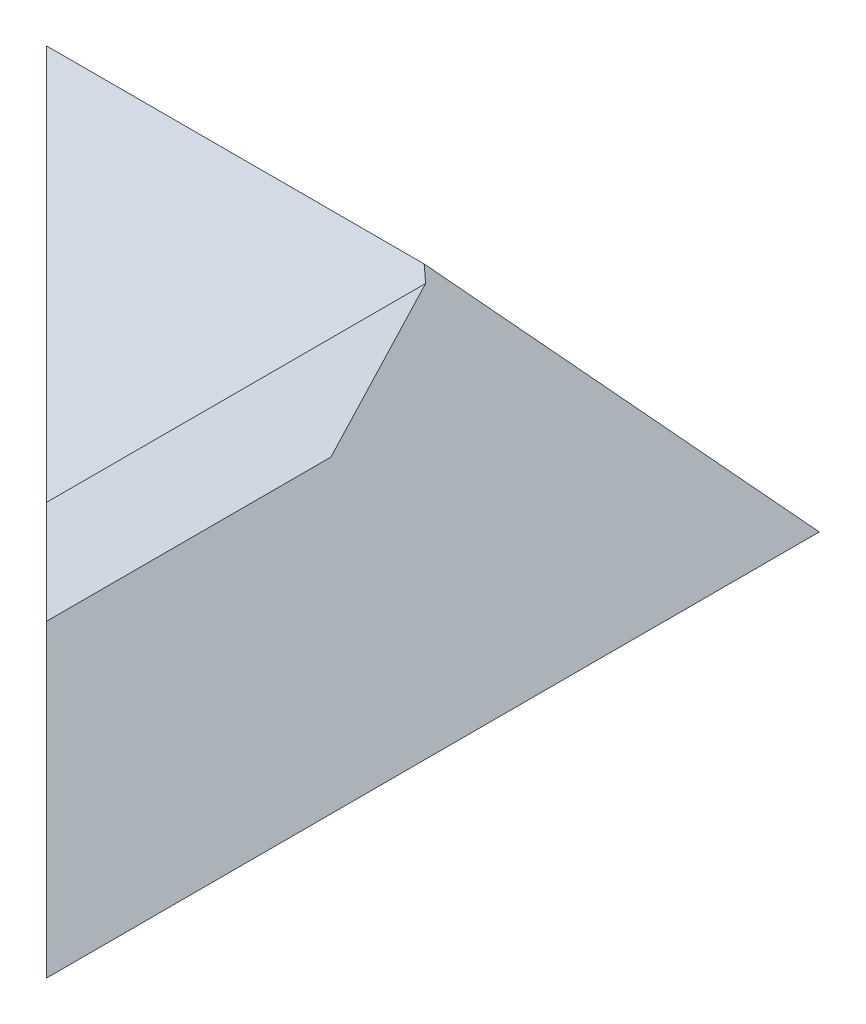
ISO-10303-21;
HEADER;
FILE_DESCRIPTION(('STEP AP214'),'2;1');
FILE_NAME('part.step','',(''),(''),'','','');
FILE_SCHEMA(('AUTOMOTIVE_DESIGN { 1 0 10303 214 1 1 1 1 }'));
ENDSEC;
DATA;
#1=APPLICATION_CONTEXT('core data for automotive mechanical design processes');
#2=APPLICATION_PROTOCOL_DEFINITION('international standard','automotive_design',2000,#1);
#3=PRODUCT_CONTEXT('',#1,'mechanical');
#4=PRODUCT('Part','Part','',(#3));
#5=PRODUCT_RELATED_PRODUCT_CATEGORY('part','',(#4));
#6=PRODUCT_DEFINITION_FORMATION('','',#4);
#7=PRODUCT_DEFINITION_CONTEXT('part definition',#1,'design');
#8=PRODUCT_DEFINITION('design','',#6,#7);
#9=PRODUCT_DEFINITION_SHAPE('','',#8);
#10=(LENGTH_UNIT() NAMED_UNIT(*) SI_UNIT(.MILLI.,.METRE.));
#11=(NAMED_UNIT(*) PLANE_ANGLE_UNIT() SI_UNIT($,.RADIAN.));
#12=(NAMED_UNIT(*) SI_UNIT($,.STERADIAN.) SOLID_ANGLE_UNIT());
#13=UNCERTAINTY_MEASURE_WITH_UNIT(LENGTH_MEASURE(1.E-05),#10,'distance_accuracy_value','');
#14=(GEOMETRIC_REPRESENTATION_CONTEXT(3) GLOBAL_UNCERTAINTY_ASSIGNED_CONTEXT((#13)) GLOBAL_UNIT_ASSIGNED_CONTEXT((#10,
#11,#12)) REPRESENTATION_CONTEXT('',''));
#15=CARTESIAN_POINT('',(0.,0.,0.));
#16=DIRECTION('',(0.,0.,1.));
#17=DIRECTION('',(1.,0.,0.));
#18=AXIS2_PLACEMENT_3D('',#15,#16,#17);
#19=CARTESIAN_POINT('',(58.0761184457489,0.,-11.9238815542511));
#20=DIRECTION('',(0.431038989319619,-0.792723646280747,-0.431038989319619));
#21=DIRECTION('',(0.,0.47769376115336,-0.878526419952841));
#22=AXIS2_PLACEMENT_3D('',#19,#20,#21);
#23=PLANE('',#22);
#24=DIRECTION('',(0.608120402411346,0.608120402411339,-0.510273605374738));
#25=VECTOR('',#24,1.);
#26=CARTESIAN_POINT('',(93.5701580153135,3.57015801531349,17.0042817261058));
#27=LINE('',#26,#25);
#28=CARTESIAN_POINT('',(90.,0.,20.));
#29=VERTEX_POINT('',#28);
#30=CARTESIAN_POINT('',(120.,29.9999999999998,-5.17298893531846));
#31=VERTEX_POINT('',#30);
#32=EDGE_CURVE('E190',#29,#31,#27,.T.);
#33=ORIENTED_EDGE('',*,*,#32,.T.);
#34=DIRECTION('',(-0.315275703929743,0.315275703929743,-0.895099134746096));
#35=VECTOR('',#34,1.);
#36=CARTESIAN_POINT('',(114.921683240356,35.0783167596445,-19.590836174627));
#37=LINE('',#36,#35);
#38=CARTESIAN_POINT('',(110.,39.9999999999998,-33.5639852470914));
#39=VERTEX_POINT('',#38);
#40=EDGE_CURVE('E195',#31,#39,#37,.T.);
#41=ORIENTED_EDGE('',*,*,#40,.T.);
#42=DIRECTION('',(-0.608120402411345,-0.608120402411339,0.510273605374739));
#43=VECTOR('',#42,1.);
#44=CARTESIAN_POINT('',(99.5848339063149,29.5848339063146,-24.8246232192299));
#45=LINE('',#44,#43);
#46=CARTESIAN_POINT('',(70.,0.,0.));
#47=VERTEX_POINT('',#46);
#48=EDGE_CURVE('E192',#39,#47,#45,.T.);
#49=ORIENTED_EDGE('',*,*,#48,.T.);
#50=DIRECTION('',(0.707106781186547,0.,0.707106781186547));
#51=VECTOR('',#50,1.);
#52=CARTESIAN_POINT('',(58.0761184457489,0.,-11.9238815542511));
#53=LINE('',#52,#51);
#54=EDGE_CURVE('E193',#47,#29,#53,.T.);
#55=ORIENTED_EDGE('',*,*,#54,.T.);
#56=EDGE_LOOP('',(#33,#41,#49,#55));
#57=FACE_BOUND('',#56,.T.);
#58=ADVANCED_FACE('F30',(#57),#23,.F.);
#59=CARTESIAN_POINT('',(150.,41.7113757407969,-35.));
#60=DIRECTION('',(0.,-0.642787609686544,0.766044443118974));
#61=DIRECTION('',(0.,-0.766044443118974,-0.642787609686544));
#62=AXIS2_PLACEMENT_3D('',#59,#60,#61);
#63=PLANE('',#62);
#64=DIRECTION('',(-1.,0.,0.));
#65=VECTOR('',#64,1.);
#66=CARTESIAN_POINT('',(150.,41.7113757407969,-35.));
#67=LINE('',#66,#65);
#68=CARTESIAN_POINT('',(108.288624259203,41.7113757407969,-35.));
#69=VERTEX_POINT('',#68);
#70=CARTESIAN_POINT('',(35.,41.7113757407969,-35.));
#71=VERTEX_POINT('',#70);
#72=EDGE_CURVE('E82',#69,#71,#67,.T.);
#73=ORIENTED_EDGE('',*,*,#72,.F.);
#74=DIRECTION('',(0.608120402411341,-0.608120402411341,-0.510273605374741));
#75=VECTOR('',#74,1.);
#76=CARTESIAN_POINT('',(123.713925800395,26.286074199605,-47.9433648340126));
#77=LINE('',#76,#75);
#78=CARTESIAN_POINT('',(150.,0.,-70.));
#79=VERTEX_POINT('',#78);
#80=EDGE_CURVE('E199',#69,#79,#77,.T.);
#81=ORIENTED_EDGE('',*,*,#80,.T.);
#82=DIRECTION('',(-1.,0.,0.));
#83=VECTOR('',#82,1.);
#84=CARTESIAN_POINT('',(150.,0.,-70.));
#85=LINE('',#84,#83);
#86=CARTESIAN_POINT('',(0.,0.,-70.));
#87=VERTEX_POINT('',#86);
#88=EDGE_CURVE('E38',#79,#87,#85,.T.);
#89=ORIENTED_EDGE('',*,*,#88,.T.);
#90=DIRECTION('',(-0.540716203060939,-0.644400477571767,-0.54071620306094));
#91=VECTOR('',#90,1.);
#92=CARTESIAN_POINT('',(68.6230114090535,81.781720381372,-1.3769885909465));
#93=LINE('',#92,#91);
#94=EDGE_CURVE('E94',#71,#87,#93,.T.);
#95=ORIENTED_EDGE('',*,*,#94,.F.);
#96=EDGE_LOOP('',(#73,#81,#89,#95));
#97=FACE_BOUND('',#96,.T.);
#98=ADVANCED_FACE('F111',(#97),#63,.F.);
#99=CARTESIAN_POINT('',(150.,0.,0.));
#100=DIRECTION('',(0.,-0.642787609686543,-0.766044443118975));
#101=DIRECTION('',(0.,0.766044443118975,-0.642787609686543));
#102=AXIS2_PLACEMENT_3D('',#99,#100,#101);
#103=PLANE('',#102);
#104=ORIENTED_EDGE('',*,*,#48,.F.);
#105=DIRECTION('',(-0.608120402411341,0.608120402411341,-0.510273605374741));
#106=VECTOR('',#105,1.);
#107=CARTESIAN_POINT('',(150.,0.,0.));
#108=LINE('',#107,#106);
#109=EDGE_CURVE('E107',#39,#69,#108,.T.);
#110=ORIENTED_EDGE('',*,*,#109,.T.);
#111=ORIENTED_EDGE('',*,*,#72,.T.);
#112=DIRECTION('',(-0.540716203060939,0.644400477571768,-0.540716203060939));
#113=VECTOR('',#112,1.);
#114=CARTESIAN_POINT('',(93.3899209802111,-27.875022358661,23.3899209802111));
#115=LINE('',#114,#113);
#116=EDGE_CURVE('E91',#47,#71,#115,.T.);
#117=ORIENTED_EDGE('',*,*,#116,.F.);
#118=EDGE_LOOP('',(#104,#110,#111,#117));
#119=FACE_BOUND('',#118,.T.);
#120=ADVANCED_FACE('F106',(#119),#103,.F.);
#121=CARTESIAN_POINT('',(120.,29.9999999999997,80.));
#122=DIRECTION('',(0.707106781186544,-0.707106781186551,0.));
#123=DIRECTION('',(0.707106781186551,0.707106781186544,0.));
#124=AXIS2_PLACEMENT_3D('',#121,#122,#123);
#125=PLANE('',#124);
#126=ORIENTED_EDGE('',*,*,#32,.F.);
#127=DIRECTION('',(-0.577350269189628,-0.577350269189622,-0.577350269189628));
#128=VECTOR('',#127,1.);
#129=CARTESIAN_POINT('',(130.,39.9999999999996,60.0000000000001));
#130=LINE('',#129,#128);
#131=CARTESIAN_POINT('',(120.,29.9999999999997,50.));
#132=VERTEX_POINT('',#131);
#133=EDGE_CURVE('E11',#132,#29,#130,.T.);
#134=ORIENTED_EDGE('',*,*,#133,.F.);
#135=DIRECTION('',(0.,0.,-1.));
#136=VECTOR('',#135,1.);
#137=CARTESIAN_POINT('',(120.,29.9999999999997,80.));
#138=LINE('',#137,#136);
#139=EDGE_CURVE('E83',#132,#31,#138,.T.);
#140=ORIENTED_EDGE('',*,*,#139,.T.);
#141=EDGE_LOOP('',(#126,#134,#140));
#142=FACE_BOUND('',#141,.T.);
#143=ADVANCED_FACE('F117',(#142),#125,.F.);
#144=CARTESIAN_POINT('',(150.,0.,-70.));
#145=DIRECTION('',(0.,1.,0.));
#146=DIRECTION('',(0.,0.,1.));
#147=AXIS2_PLACEMENT_3D('',#144,#145,#146);
#148=PLANE('',#147);
#149=DIRECTION('',(0.,0.,-1.));
#150=VECTOR('',#149,1.);
#151=CARTESIAN_POINT('',(150.,0.,-70.));
#152=LINE('',#151,#150);
#153=CARTESIAN_POINT('',(150.,0.,80.));
#154=VERTEX_POINT('',#153);
#155=EDGE_CURVE('E78',#154,#79,#152,.T.);
#156=ORIENTED_EDGE('',*,*,#155,.F.);
#157=DIRECTION('',(-0.707106781186547,0.,-0.707106781186548));
#158=VECTOR('',#157,1.);
#159=CARTESIAN_POINT('',(0.,0.,-70.));
#160=LINE('',#159,#158);
#161=EDGE_CURVE('E80',#154,#29,#160,.T.);
#162=ORIENTED_EDGE('',*,*,#161,.T.);
#163=ORIENTED_EDGE('',*,*,#54,.F.);
#164=EDGE_CURVE('E86',#47,#87,#160,.T.);
#165=ORIENTED_EDGE('',*,*,#164,.T.);
#166=ORIENTED_EDGE('',*,*,#88,.F.);
#167=EDGE_LOOP('',(#156,#162,#163,#165,#166));
#168=FACE_BOUND('',#167,.T.);
#169=ADVANCED_FACE('F32',(#168),#148,.F.);
#170=CARTESIAN_POINT('',(150.,0.,80.));
#171=DIRECTION('',(-0.707106781186544,-0.707106781186551,0.));
#172=DIRECTION('',(0.707106781186551,-0.707106781186544,0.));
#173=AXIS2_PLACEMENT_3D('',#170,#171,#172);
#174=PLANE('',#173);
#175=ORIENTED_EDGE('',*,*,#155,.T.);
#176=ORIENTED_EDGE('',*,*,#80,.F.);
#177=ORIENTED_EDGE('',*,*,#109,.F.);
#178=ORIENTED_EDGE('',*,*,#40,.F.);
#179=ORIENTED_EDGE('',*,*,#139,.F.);
#180=DIRECTION('',(-0.577350269189628,0.577350269189622,-0.577350269189628));
#181=VECTOR('',#180,1.);
#182=CARTESIAN_POINT('',(150.,0.,80.));
#183=LINE('',#182,#181);
#184=EDGE_CURVE('E44',#154,#132,#183,.T.);
#185=ORIENTED_EDGE('',*,*,#184,.F.);
#186=EDGE_LOOP('',(#175,#176,#177,#178,#179,#185));
#187=FACE_BOUND('',#186,.T.);
#188=ADVANCED_FACE('F89',(#187),#174,.F.);
#189=CARTESIAN_POINT('',(0.,41.7113757407969,-70.));
#190=DIRECTION('',(-0.707106781186548,0.,0.707106781186547));
#191=DIRECTION('',(0.707106781186547,0.,0.707106781186548));
#192=AXIS2_PLACEMENT_3D('',#189,#190,#191);
#193=PLANE('',#192);
#194=ORIENTED_EDGE('',*,*,#184,.T.);
#195=ORIENTED_EDGE('',*,*,#133,.T.);
#196=ORIENTED_EDGE('',*,*,#161,.F.);
#197=EDGE_LOOP('',(#194,#195,#196));
#198=FACE_BOUND('',#197,.T.);
#199=ADVANCED_FACE('F85',(#198),#193,.T.);
#200=ORIENTED_EDGE('',*,*,#94,.T.);
#201=ORIENTED_EDGE('',*,*,#164,.F.);
#202=ORIENTED_EDGE('',*,*,#116,.T.);
#203=EDGE_LOOP('',(#200,#201,#202));
#204=FACE_BOUND('',#203,.T.);
#205=ADVANCED_FACE('F110',(#204),#193,.T.);
#206=CLOSED_SHELL('',(#58,#98,#120,#143,#169,#188,#199,#205));
#207=MANIFOLD_SOLID_BREP('B2',#206);
#208=ADVANCED_BREP_SHAPE_REPRESENTATION('',(#18,#207),#14);
#209=SHAPE_DEFINITION_REPRESENTATION(#9,#208);
ENDSEC;
END-ISO-10303-21;
